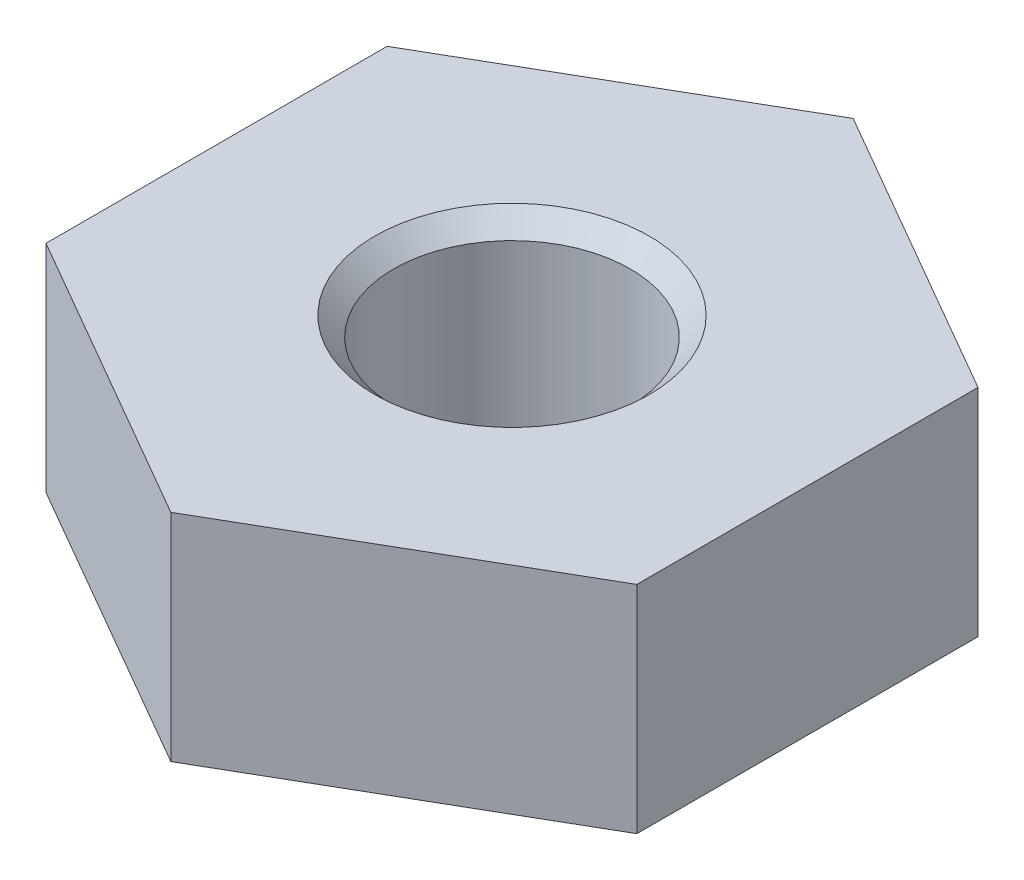
ISO-10303-21;
HEADER;
FILE_DESCRIPTION(('STEP AP214'),'2;1');
FILE_NAME('part.step','',(''),(''),'','','');
FILE_SCHEMA(('AUTOMOTIVE_DESIGN { 1 0 10303 214 1 1 1 1 }'));
ENDSEC;
DATA;
#1=APPLICATION_CONTEXT('core data for automotive mechanical design processes');
#2=APPLICATION_PROTOCOL_DEFINITION('international standard','automotive_design',2000,#1);
#3=PRODUCT_CONTEXT('',#1,'mechanical');
#4=PRODUCT('Part','Part','',(#3));
#5=PRODUCT_RELATED_PRODUCT_CATEGORY('part','',(#4));
#6=PRODUCT_DEFINITION_FORMATION('','',#4);
#7=PRODUCT_DEFINITION_CONTEXT('part definition',#1,'design');
#8=PRODUCT_DEFINITION('design','',#6,#7);
#9=PRODUCT_DEFINITION_SHAPE('','',#8);
#10=(LENGTH_UNIT() NAMED_UNIT(*) SI_UNIT(.MILLI.,.METRE.));
#11=(NAMED_UNIT(*) PLANE_ANGLE_UNIT() SI_UNIT($,.RADIAN.));
#12=(NAMED_UNIT(*) SI_UNIT($,.STERADIAN.) SOLID_ANGLE_UNIT());
#13=UNCERTAINTY_MEASURE_WITH_UNIT(LENGTH_MEASURE(1.E-05),#10,'distance_accuracy_value','');
#14=(GEOMETRIC_REPRESENTATION_CONTEXT(3) GLOBAL_UNCERTAINTY_ASSIGNED_CONTEXT((#13)) GLOBAL_UNIT_ASSIGNED_CONTEXT((#10,
#11,#12)) REPRESENTATION_CONTEXT('',''));
#15=CARTESIAN_POINT('',(0.,0.,0.));
#16=DIRECTION('',(0.,0.,1.));
#17=DIRECTION('',(1.,0.,0.));
#18=AXIS2_PLACEMENT_3D('',#15,#16,#17);
#19=CARTESIAN_POINT('',(-3.9624,2.8956,2.28769270663697));
#20=DIRECTION('',(0.5,0.,-0.866025403784439));
#21=DIRECTION('',(-0.866025403784439,0.,-0.5));
#22=AXIS2_PLACEMENT_3D('',#19,#20,#21);
#23=PLANE('',#22);
#24=DIRECTION('',(0.866025403784439,0.,0.5));
#25=VECTOR('',#24,1.);
#26=CARTESIAN_POINT('',(-3.9624,0.,2.28769270663697));
#27=LINE('',#26,#25);
#28=CARTESIAN_POINT('',(-3.9624,0.,2.28769270663697));
#29=VERTEX_POINT('',#28);
#30=CARTESIAN_POINT('',(0.,0.,4.57538541327395));
#31=VERTEX_POINT('',#30);
#32=EDGE_CURVE('E136',#29,#31,#27,.T.);
#33=ORIENTED_EDGE('',*,*,#32,.T.);
#34=DIRECTION('',(0.,-1.,0.));
#35=VECTOR('',#34,1.);
#36=CARTESIAN_POINT('',(0.,2.8956,4.57538541327395));
#37=LINE('',#36,#35);
#38=CARTESIAN_POINT('',(0.,2.8956,4.57538541327395));
#39=VERTEX_POINT('',#38);
#40=EDGE_CURVE('E163',#39,#31,#37,.T.);
#41=ORIENTED_EDGE('',*,*,#40,.F.);
#42=DIRECTION('',(0.866025403784439,0.,0.5));
#43=VECTOR('',#42,1.);
#44=CARTESIAN_POINT('',(-3.9624,2.8956,2.28769270663697));
#45=LINE('',#44,#43);
#46=CARTESIAN_POINT('',(-3.9624,2.8956,2.28769270663697));
#47=VERTEX_POINT('',#46);
#48=EDGE_CURVE('E152',#47,#39,#45,.T.);
#49=ORIENTED_EDGE('',*,*,#48,.F.);
#50=DIRECTION('',(0.,-1.,0.));
#51=VECTOR('',#50,1.);
#52=CARTESIAN_POINT('',(-3.9624,2.8956,2.28769270663697));
#53=LINE('',#52,#51);
#54=EDGE_CURVE('E132',#47,#29,#53,.T.);
#55=ORIENTED_EDGE('',*,*,#54,.T.);
#56=EDGE_LOOP('',(#33,#41,#49,#55));
#57=FACE_BOUND('',#56,.T.);
#58=ADVANCED_FACE('F44',(#57),#23,.F.);
#59=CARTESIAN_POINT('',(0.,2.8956,4.57538541327395));
#60=DIRECTION('',(-0.5,0.,-0.866025403784439));
#61=DIRECTION('',(-0.866025403784439,0.,0.5));
#62=AXIS2_PLACEMENT_3D('',#59,#60,#61);
#63=PLANE('',#62);
#64=DIRECTION('',(0.866025403784439,0.,-0.5));
#65=VECTOR('',#64,1.);
#66=CARTESIAN_POINT('',(0.,0.,4.57538541327395));
#67=LINE('',#66,#65);
#68=CARTESIAN_POINT('',(3.9624,0.,2.28769270663697));
#69=VERTEX_POINT('',#68);
#70=EDGE_CURVE('E140',#31,#69,#67,.T.);
#71=ORIENTED_EDGE('',*,*,#70,.T.);
#72=DIRECTION('',(0.,-1.,0.));
#73=VECTOR('',#72,1.);
#74=CARTESIAN_POINT('',(3.9624,2.8956,2.28769270663697));
#75=LINE('',#74,#73);
#76=CARTESIAN_POINT('',(3.9624,2.8956,2.28769270663697));
#77=VERTEX_POINT('',#76);
#78=EDGE_CURVE('E159',#77,#69,#75,.T.);
#79=ORIENTED_EDGE('',*,*,#78,.F.);
#80=DIRECTION('',(0.866025403784439,0.,-0.5));
#81=VECTOR('',#80,1.);
#82=CARTESIAN_POINT('',(0.,2.8956,4.57538541327395));
#83=LINE('',#82,#81);
#84=EDGE_CURVE('E101',#39,#77,#83,.T.);
#85=ORIENTED_EDGE('',*,*,#84,.F.);
#86=ORIENTED_EDGE('',*,*,#40,.T.);
#87=EDGE_LOOP('',(#71,#79,#85,#86));
#88=FACE_BOUND('',#87,.T.);
#89=ADVANCED_FACE('F190',(#88),#63,.F.);
#90=CARTESIAN_POINT('',(3.9624,2.8956,2.28769270663697));
#91=DIRECTION('',(-1.,0.,0.));
#92=DIRECTION('',(0.,0.,1.));
#93=AXIS2_PLACEMENT_3D('',#90,#91,#92);
#94=PLANE('',#93);
#95=DIRECTION('',(0.,0.,-1.));
#96=VECTOR('',#95,1.);
#97=CARTESIAN_POINT('',(3.9624,0.,2.28769270663697));
#98=LINE('',#97,#96);
#99=CARTESIAN_POINT('',(3.9624,0.,-2.28769270663697));
#100=VERTEX_POINT('',#99);
#101=EDGE_CURVE('E143',#69,#100,#98,.T.);
#102=ORIENTED_EDGE('',*,*,#101,.T.);
#103=DIRECTION('',(0.,-1.,0.));
#104=VECTOR('',#103,1.);
#105=CARTESIAN_POINT('',(3.9624,2.8956,-2.28769270663697));
#106=LINE('',#105,#104);
#107=CARTESIAN_POINT('',(3.9624,2.8956,-2.28769270663697));
#108=VERTEX_POINT('',#107);
#109=EDGE_CURVE('E125',#108,#100,#106,.T.);
#110=ORIENTED_EDGE('',*,*,#109,.F.);
#111=DIRECTION('',(0.,0.,-1.));
#112=VECTOR('',#111,1.);
#113=CARTESIAN_POINT('',(3.9624,2.8956,2.28769270663697));
#114=LINE('',#113,#112);
#115=EDGE_CURVE('E114',#77,#108,#114,.T.);
#116=ORIENTED_EDGE('',*,*,#115,.F.);
#117=ORIENTED_EDGE('',*,*,#78,.T.);
#118=EDGE_LOOP('',(#102,#110,#116,#117));
#119=FACE_BOUND('',#118,.T.);
#120=ADVANCED_FACE('F196',(#119),#94,.F.);
#121=CARTESIAN_POINT('',(3.9624,2.8956,-2.28769270663697));
#122=DIRECTION('',(-0.5,0.,0.866025403784439));
#123=DIRECTION('',(0.866025403784439,0.,0.5));
#124=AXIS2_PLACEMENT_3D('',#121,#122,#123);
#125=PLANE('',#124);
#126=DIRECTION('',(-0.866025403784439,0.,-0.5));
#127=VECTOR('',#126,1.);
#128=CARTESIAN_POINT('',(3.9624,0.,-2.28769270663697));
#129=LINE('',#128,#127);
#130=CARTESIAN_POINT('',(0.,0.,-4.57538541327395));
#131=VERTEX_POINT('',#130);
#132=EDGE_CURVE('E123',#100,#131,#129,.T.);
#133=ORIENTED_EDGE('',*,*,#132,.T.);
#134=DIRECTION('',(0.,-1.,0.));
#135=VECTOR('',#134,1.);
#136=CARTESIAN_POINT('',(0.,2.8956,-4.57538541327395));
#137=LINE('',#136,#135);
#138=CARTESIAN_POINT('',(0.,2.8956,-4.57538541327395));
#139=VERTEX_POINT('',#138);
#140=EDGE_CURVE('E120',#139,#131,#137,.T.);
#141=ORIENTED_EDGE('',*,*,#140,.F.);
#142=DIRECTION('',(-0.866025403784439,0.,-0.5));
#143=VECTOR('',#142,1.);
#144=CARTESIAN_POINT('',(3.9624,2.8956,-2.28769270663697));
#145=LINE('',#144,#143);
#146=EDGE_CURVE('E108',#108,#139,#145,.T.);
#147=ORIENTED_EDGE('',*,*,#146,.F.);
#148=ORIENTED_EDGE('',*,*,#109,.T.);
#149=EDGE_LOOP('',(#133,#141,#147,#148));
#150=FACE_BOUND('',#149,.T.);
#151=ADVANCED_FACE('F121',(#150),#125,.F.);
#152=CARTESIAN_POINT('',(0.,2.8956,-4.57538541327395));
#153=DIRECTION('',(0.5,0.,0.866025403784439));
#154=DIRECTION('',(0.866025403784439,0.,-0.5));
#155=AXIS2_PLACEMENT_3D('',#152,#153,#154);
#156=PLANE('',#155);
#157=DIRECTION('',(-0.866025403784439,0.,0.5));
#158=VECTOR('',#157,1.);
#159=CARTESIAN_POINT('',(0.,0.,-4.57538541327395));
#160=LINE('',#159,#158);
#161=CARTESIAN_POINT('',(-3.9624,0.,-2.28769270663697));
#162=VERTEX_POINT('',#161);
#163=EDGE_CURVE('E86',#131,#162,#160,.T.);
#164=ORIENTED_EDGE('',*,*,#163,.T.);
#165=DIRECTION('',(0.,-1.,0.));
#166=VECTOR('',#165,1.);
#167=CARTESIAN_POINT('',(-3.9624,2.8956,-2.28769270663697));
#168=LINE('',#167,#166);
#169=CARTESIAN_POINT('',(-3.9624,2.8956,-2.28769270663697));
#170=VERTEX_POINT('',#169);
#171=EDGE_CURVE('E126',#170,#162,#168,.T.);
#172=ORIENTED_EDGE('',*,*,#171,.F.);
#173=DIRECTION('',(-0.866025403784439,0.,0.5));
#174=VECTOR('',#173,1.);
#175=CARTESIAN_POINT('',(0.,2.8956,-4.57538541327395));
#176=LINE('',#175,#174);
#177=EDGE_CURVE('E112',#139,#170,#176,.T.);
#178=ORIENTED_EDGE('',*,*,#177,.F.);
#179=ORIENTED_EDGE('',*,*,#140,.T.);
#180=EDGE_LOOP('',(#164,#172,#178,#179));
#181=FACE_BOUND('',#180,.T.);
#182=ADVANCED_FACE('F128',(#181),#156,.F.);
#183=CARTESIAN_POINT('',(-3.9624,2.8956,-2.28769270663697));
#184=DIRECTION('',(1.,0.,0.));
#185=DIRECTION('',(0.,0.,-1.));
#186=AXIS2_PLACEMENT_3D('',#183,#184,#185);
#187=PLANE('',#186);
#188=DIRECTION('',(0.,0.,1.));
#189=VECTOR('',#188,1.);
#190=CARTESIAN_POINT('',(-3.9624,0.,-2.28769270663697));
#191=LINE('',#190,#189);
#192=EDGE_CURVE('E92',#162,#29,#191,.T.);
#193=ORIENTED_EDGE('',*,*,#192,.T.);
#194=ORIENTED_EDGE('',*,*,#54,.F.);
#195=DIRECTION('',(0.,0.,1.));
#196=VECTOR('',#195,1.);
#197=CARTESIAN_POINT('',(-3.9624,2.8956,-2.28769270663697));
#198=LINE('',#197,#196);
#199=EDGE_CURVE('E63',#170,#47,#198,.T.);
#200=ORIENTED_EDGE('',*,*,#199,.F.);
#201=ORIENTED_EDGE('',*,*,#171,.T.);
#202=EDGE_LOOP('',(#193,#194,#200,#201));
#203=FACE_BOUND('',#202,.T.);
#204=ADVANCED_FACE('F211',(#203),#187,.F.);
#205=CARTESIAN_POINT('',(0.,2.8956,0.));
#206=DIRECTION('',(0.,1.,0.));
#207=DIRECTION('',(0.,0.,1.));
#208=AXIS2_PLACEMENT_3D('',#205,#206,#207);
#209=PLANE('',#208);
#210=CARTESIAN_POINT('',(0.,2.8956,0.));
#211=DIRECTION('',(0.,1.,0.));
#212=DIRECTION('',(0.,0.,1.));
#213=AXIS2_PLACEMENT_3D('',#210,#211,#212);
#214=CIRCLE('',#213,1.8415);
#215=CARTESIAN_POINT('',(0.,2.8956,1.8415));
#216=VERTEX_POINT('',#215);
#217=EDGE_CURVE('E170',#216,#216,#214,.F.);
#218=ORIENTED_EDGE('',*,*,#217,.T.);
#219=EDGE_LOOP('',(#218));
#220=FACE_BOUND('',#219,.T.);
#221=ORIENTED_EDGE('',*,*,#48,.T.);
#222=ORIENTED_EDGE('',*,*,#84,.T.);
#223=ORIENTED_EDGE('',*,*,#115,.T.);
#224=ORIENTED_EDGE('',*,*,#146,.T.);
#225=ORIENTED_EDGE('',*,*,#177,.T.);
#226=ORIENTED_EDGE('',*,*,#199,.T.);
#227=EDGE_LOOP('',(#221,#222,#223,#224,#225,#226));
#228=FACE_BOUND('',#227,.T.);
#229=ADVANCED_FACE('F110',(#220,#228),#209,.T.);
#230=CARTESIAN_POINT('',(0.,0.,0.));
#231=DIRECTION('',(0.,1.,0.));
#232=DIRECTION('',(0.,0.,1.));
#233=AXIS2_PLACEMENT_3D('',#230,#231,#232);
#234=PLANE('',#233);
#235=CARTESIAN_POINT('',(0.,0.,0.));
#236=DIRECTION('',(0.,1.,0.));
#237=DIRECTION('',(0.,0.,1.));
#238=AXIS2_PLACEMENT_3D('',#235,#236,#237);
#239=CIRCLE('',#238,1.8415);
#240=CARTESIAN_POINT('',(0.,0.,1.8415));
#241=VERTEX_POINT('',#240);
#242=EDGE_CURVE('E55',#241,#241,#239,.T.);
#243=ORIENTED_EDGE('',*,*,#242,.T.);
#244=EDGE_LOOP('',(#243));
#245=FACE_BOUND('',#244,.T.);
#246=ORIENTED_EDGE('',*,*,#32,.F.);
#247=ORIENTED_EDGE('',*,*,#192,.F.);
#248=ORIENTED_EDGE('',*,*,#163,.F.);
#249=ORIENTED_EDGE('',*,*,#132,.F.);
#250=ORIENTED_EDGE('',*,*,#101,.F.);
#251=ORIENTED_EDGE('',*,*,#70,.F.);
#252=EDGE_LOOP('',(#246,#247,#248,#249,#250,#251));
#253=FACE_BOUND('',#252,.T.);
#254=ADVANCED_FACE('F177',(#245,#253),#234,.F.);
#255=CARTESIAN_POINT('',(0.,0.,0.));
#256=DIRECTION('',(0.,1.,0.));
#257=DIRECTION('',(0.,0.,1.));
#258=AXIS2_PLACEMENT_3D('',#255,#256,#257);
#259=CYLINDRICAL_SURFACE('',#258,1.5875);
#260=CARTESIAN_POINT('',(0.,0.254000000000001,0.));
#261=DIRECTION('',(0.,1.,0.));
#262=DIRECTION('',(0.,0.,1.));
#263=AXIS2_PLACEMENT_3D('',#260,#261,#262);
#264=CIRCLE('',#263,1.5875);
#265=CARTESIAN_POINT('',(0.,0.254000000000001,1.5875));
#266=VERTEX_POINT('',#265);
#267=EDGE_CURVE('E11',#266,#266,#264,.F.);
#268=ORIENTED_EDGE('',*,*,#267,.T.);
#269=EDGE_LOOP('',(#268));
#270=FACE_BOUND('',#269,.T.);
#271=CARTESIAN_POINT('',(0.,2.6416,0.));
#272=DIRECTION('',(0.,1.,0.));
#273=DIRECTION('',(0.,0.,1.));
#274=AXIS2_PLACEMENT_3D('',#271,#272,#273);
#275=CIRCLE('',#274,1.5875);
#276=CARTESIAN_POINT('',(0.,2.6416,1.5875));
#277=VERTEX_POINT('',#276);
#278=EDGE_CURVE('E166',#277,#277,#275,.T.);
#279=ORIENTED_EDGE('',*,*,#278,.T.);
#280=EDGE_LOOP('',(#279));
#281=FACE_BOUND('',#280,.T.);
#282=ADVANCED_FACE('F186',(#270,#281),#259,.F.);
#283=CARTESIAN_POINT('',(0.,2.6416,0.));
#284=DIRECTION('',(0.,1.,0.));
#285=DIRECTION('',(0.,0.,1.));
#286=AXIS2_PLACEMENT_3D('',#283,#284,#285);
#287=CONICAL_SURFACE('',#286,1.5875,0.785398163397448);
#288=ORIENTED_EDGE('',*,*,#217,.F.);
#289=EDGE_LOOP('',(#288));
#290=FACE_BOUND('',#289,.T.);
#291=ORIENTED_EDGE('',*,*,#278,.F.);
#292=EDGE_LOOP('',(#291));
#293=FACE_BOUND('',#292,.T.);
#294=ADVANCED_FACE('F181',(#290,#293),#287,.F.);
#295=CARTESIAN_POINT('',(0.,0.,0.));
#296=DIRECTION('',(0.,-1.,0.));
#297=DIRECTION('',(0.,0.,-1.));
#298=AXIS2_PLACEMENT_3D('',#295,#296,#297);
#299=CONICAL_SURFACE('',#298,1.8415,0.785398163397447);
#300=ORIENTED_EDGE('',*,*,#267,.F.);
#301=EDGE_LOOP('',(#300));
#302=FACE_BOUND('',#301,.T.);
#303=ORIENTED_EDGE('',*,*,#242,.F.);
#304=EDGE_LOOP('',(#303));
#305=FACE_BOUND('',#304,.T.);
#306=ADVANCED_FACE('F47',(#302,#305),#299,.F.);
#307=CLOSED_SHELL('',(#58,#89,#120,#151,#182,#204,#229,#254,#282,#294,#306));
#308=MANIFOLD_SOLID_BREP('B2',#307);
#309=ADVANCED_BREP_SHAPE_REPRESENTATION('',(#18,#308),#14);
#310=SHAPE_DEFINITION_REPRESENTATION(#9,#309);
ENDSEC;
END-ISO-10303-21;
